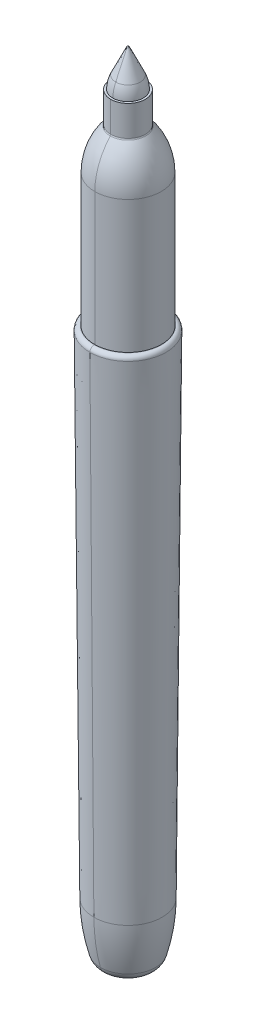
ISO-10303-21;
HEADER;
FILE_DESCRIPTION(('STEP AP214'),'2;1');
FILE_NAME('part.step','',(''),(''),'','','');
FILE_SCHEMA(('AUTOMOTIVE_DESIGN { 1 0 10303 214 1 1 1 1 }'));
ENDSEC;
DATA;
#1=APPLICATION_CONTEXT('core data for automotive mechanical design processes');
#2=APPLICATION_PROTOCOL_DEFINITION('international standard','automotive_design',2000,#1);
#3=PRODUCT_CONTEXT('',#1,'mechanical');
#4=PRODUCT('Part','Part','',(#3));
#5=PRODUCT_RELATED_PRODUCT_CATEGORY('part','',(#4));
#6=PRODUCT_DEFINITION_FORMATION('','',#4);
#7=PRODUCT_DEFINITION_CONTEXT('part definition',#1,'design');
#8=PRODUCT_DEFINITION('design','',#6,#7);
#9=PRODUCT_DEFINITION_SHAPE('','',#8);
#10=(LENGTH_UNIT() NAMED_UNIT(*) SI_UNIT(.MILLI.,.METRE.));
#11=(NAMED_UNIT(*) PLANE_ANGLE_UNIT() SI_UNIT($,.RADIAN.));
#12=(NAMED_UNIT(*) SI_UNIT($,.STERADIAN.) SOLID_ANGLE_UNIT());
#13=UNCERTAINTY_MEASURE_WITH_UNIT(LENGTH_MEASURE(1.E-05),#10,'distance_accuracy_value','');
#14=(GEOMETRIC_REPRESENTATION_CONTEXT(3) GLOBAL_UNCERTAINTY_ASSIGNED_CONTEXT((#13)) GLOBAL_UNIT_ASSIGNED_CONTEXT((#10,
#11,#12)) REPRESENTATION_CONTEXT('',''));
#15=CARTESIAN_POINT('',(0.,0.,0.));
#16=DIRECTION('',(0.,0.,1.));
#17=DIRECTION('',(1.,0.,0.));
#18=AXIS2_PLACEMENT_3D('',#15,#16,#17);
#19=CARTESIAN_POINT('',(0.,116.955274419024,0.));
#20=DIRECTION('',(0.,-1.,0.));
#21=DIRECTION('',(0.,0.,-1.));
#22=AXIS2_PLACEMENT_3D('',#19,#20,#21);
#23=TOROIDAL_SURFACE('',#22,3.09,0.3);
#24=CARTESIAN_POINT('',(0.,116.955274419024,3.09));
#25=DIRECTION('',(1.,0.,0.));
#26=DIRECTION('',(0.,0.,-1.));
#27=AXIS2_PLACEMENT_3D('',#24,#25,#26);
#28=CIRCLE('',#27,0.3);
#29=CARTESIAN_POINT('',(0.,116.755670458628,2.8660396039604));
#30=VERTEX_POINT('',#29);
#31=CARTESIAN_POINT('',(0.,116.955274419024,2.79));
#32=VERTEX_POINT('',#31);
#33=EDGE_CURVE('P0_E125',#30,#32,#28,.T.);
#34=ORIENTED_EDGE('',*,*,#33,.F.);
#35=CARTESIAN_POINT('',(0.,116.755670458628,0.));
#36=DIRECTION('',(0.,-1.,0.));
#37=DIRECTION('',(0.,0.,-1.));
#38=AXIS2_PLACEMENT_3D('',#35,#36,#37);
#39=CIRCLE('',#38,2.8660396039604);
#40=CARTESIAN_POINT('',(0.,116.755670458628,-2.8660396039604));
#41=VERTEX_POINT('',#40);
#42=EDGE_CURVE('P0_E107',#41,#30,#39,.T.);
#43=ORIENTED_EDGE('',*,*,#42,.F.);
#44=CARTESIAN_POINT('',(0.,116.955274419024,-3.09));
#45=DIRECTION('',(-1.,0.,0.));
#46=DIRECTION('',(0.,0.,1.));
#47=AXIS2_PLACEMENT_3D('',#44,#45,#46);
#48=CIRCLE('',#47,0.3);
#49=CARTESIAN_POINT('',(0.,116.955274419024,-2.79));
#50=VERTEX_POINT('',#49);
#51=EDGE_CURVE('P0_E122',#41,#50,#48,.T.);
#52=ORIENTED_EDGE('',*,*,#51,.T.);
#53=CARTESIAN_POINT('',(0.,116.955274419024,0.));
#54=DIRECTION('',(0.,1.,0.));
#55=DIRECTION('',(0.,0.,-1.));
#56=AXIS2_PLACEMENT_3D('',#53,#54,#55);
#57=CIRCLE('',#56,2.79);
#58=EDGE_CURVE('P0_E154',#32,#50,#57,.T.);
#59=ORIENTED_EDGE('',*,*,#58,.F.);
#60=EDGE_LOOP('',(#34,#43,#52,#59));
#61=FACE_BOUND('',#60,.T.);
#62=ADVANCED_FACE('P0_F17',(#61),#23,.F.);
#63=CARTESIAN_POINT('',(0.,120.84,0.));
#64=DIRECTION('',(0.,1.,0.));
#65=DIRECTION('',(1.,0.,0.));
#66=AXIS2_PLACEMENT_3D('',#63,#64,#65);
#67=PLANE('',#66);
#68=CARTESIAN_POINT('',(0.,120.84,0.));
#69=DIRECTION('',(0.,1.,0.));
#70=DIRECTION('',(0.,0.,1.));
#71=AXIS2_PLACEMENT_3D('',#68,#69,#70);
#72=CIRCLE('',#71,2.45);
#73=CARTESIAN_POINT('',(0.,120.84,2.45));
#74=VERTEX_POINT('',#73);
#75=CARTESIAN_POINT('',(0.,120.84,-2.45));
#76=VERTEX_POINT('',#75);
#77=EDGE_CURVE('P0_E11',#74,#76,#72,.T.);
#78=ORIENTED_EDGE('',*,*,#77,.T.);
#79=CARTESIAN_POINT('',(0.,120.84,0.));
#80=DIRECTION('',(0.,1.,0.));
#81=DIRECTION('',(0.,0.,1.));
#82=AXIS2_PLACEMENT_3D('',#79,#80,#81);
#83=CIRCLE('',#82,2.45);
#84=EDGE_CURVE('P0_E134',#76,#74,#83,.T.);
#85=ORIENTED_EDGE('',*,*,#84,.T.);
#86=EDGE_LOOP('',(#78,#85));
#87=FACE_BOUND('',#86,.T.);
#88=ADVANCED_FACE('P0_F318',(#87),#67,.T.);
#89=CARTESIAN_POINT('',(0.,120.84,0.));
#90=DIRECTION('',(0.,1.,0.));
#91=DIRECTION('',(0.,0.,1.));
#92=AXIS2_PLACEMENT_3D('',#89,#90,#91);
#93=CYLINDRICAL_SURFACE('',#92,2.45);
#94=DIRECTION('',(0.,1.,0.));
#95=VECTOR('',#94,1.);
#96=CARTESIAN_POINT('',(0.,120.84,-2.45));
#97=LINE('',#96,#95);
#98=CARTESIAN_POINT('',(0.,121.84,-2.45));
#99=VERTEX_POINT('',#98);
#100=EDGE_CURVE('P0_E146',#76,#99,#97,.T.);
#101=ORIENTED_EDGE('',*,*,#100,.F.);
#102=ORIENTED_EDGE('',*,*,#77,.F.);
#103=DIRECTION('',(0.,1.,0.));
#104=VECTOR('',#103,1.);
#105=CARTESIAN_POINT('',(0.,120.84,2.45));
#106=LINE('',#105,#104);
#107=CARTESIAN_POINT('',(0.,121.84,2.45));
#108=VERTEX_POINT('',#107);
#109=EDGE_CURVE('P0_E160',#74,#108,#106,.T.);
#110=ORIENTED_EDGE('',*,*,#109,.T.);
#111=CARTESIAN_POINT('',(0.,121.84,0.));
#112=DIRECTION('',(0.,1.,0.));
#113=DIRECTION('',(0.,0.,1.));
#114=AXIS2_PLACEMENT_3D('',#111,#112,#113);
#115=CIRCLE('',#114,2.45);
#116=EDGE_CURVE('P0_E68',#108,#99,#115,.T.);
#117=ORIENTED_EDGE('',*,*,#116,.T.);
#118=EDGE_LOOP('',(#101,#102,#110,#117));
#119=FACE_BOUND('',#118,.T.);
#120=ADVANCED_FACE('P0_F19',(#119),#93,.F.);
#121=CARTESIAN_POINT('',(0.,88.4,0.));
#122=DIRECTION('',(0.,-1.,0.));
#123=DIRECTION('',(0.,0.,-1.));
#124=AXIS2_PLACEMENT_3D('',#121,#122,#123);
#125=PLANE('',#124);
#126=CARTESIAN_POINT('',(0.,88.4,0.));
#127=DIRECTION('',(0.,-1.,0.));
#128=DIRECTION('',(0.,0.,-1.));
#129=AXIS2_PLACEMENT_3D('',#126,#127,#128);
#130=CIRCLE('',#129,5.35);
#131=CARTESIAN_POINT('',(0.,88.4,-5.35));
#132=VERTEX_POINT('',#131);
#133=CARTESIAN_POINT('',(0.,88.4,5.35));
#134=VERTEX_POINT('',#133);
#135=EDGE_CURVE('P0_E192',#132,#134,#130,.T.);
#136=ORIENTED_EDGE('',*,*,#135,.T.);
#137=CARTESIAN_POINT('',(0.,88.4,0.));
#138=DIRECTION('',(0.,-1.,0.));
#139=DIRECTION('',(0.,0.,-1.));
#140=AXIS2_PLACEMENT_3D('',#137,#138,#139);
#141=CIRCLE('',#140,5.35);
#142=EDGE_CURVE('P0_E28',#134,#132,#141,.T.);
#143=ORIENTED_EDGE('',*,*,#142,.T.);
#144=EDGE_LOOP('',(#136,#143));
#145=FACE_BOUND('',#144,.T.);
#146=ADVANCED_FACE('P0_F190',(#145),#125,.T.);
#147=CARTESIAN_POINT('',(0.,88.4,0.));
#148=DIRECTION('',(0.,-1.,0.));
#149=DIRECTION('',(0.,0.,-1.));
#150=AXIS2_PLACEMENT_3D('',#147,#148,#149);
#151=CYLINDRICAL_SURFACE('',#150,5.35);
#152=DIRECTION('',(0.,-1.,0.));
#153=VECTOR('',#152,1.);
#154=CARTESIAN_POINT('',(0.,88.4,5.35));
#155=LINE('',#154,#153);
#156=CARTESIAN_POINT('',(0.,110.235274419024,5.35));
#157=VERTEX_POINT('',#156);
#158=EDGE_CURVE('P0_E176',#157,#134,#155,.T.);
#159=ORIENTED_EDGE('',*,*,#158,.F.);
#160=CARTESIAN_POINT('',(0.,110.235274419024,0.));
#161=DIRECTION('',(0.,-1.,0.));
#162=DIRECTION('',(0.,0.,-1.));
#163=AXIS2_PLACEMENT_3D('',#160,#161,#162);
#164=CIRCLE('',#163,5.35);
#165=CARTESIAN_POINT('',(0.,110.235274419024,-5.35));
#166=VERTEX_POINT('',#165);
#167=EDGE_CURVE('P0_E171',#157,#166,#164,.T.);
#168=ORIENTED_EDGE('',*,*,#167,.T.);
#169=DIRECTION('',(0.,-1.,0.));
#170=VECTOR('',#169,1.);
#171=CARTESIAN_POINT('',(0.,88.4,-5.35));
#172=LINE('',#171,#170);
#173=EDGE_CURVE('P0_E21',#166,#132,#172,.T.);
#174=ORIENTED_EDGE('',*,*,#173,.T.);
#175=ORIENTED_EDGE('',*,*,#142,.F.);
#176=EDGE_LOOP('',(#159,#168,#174,#175));
#177=FACE_BOUND('',#176,.T.);
#178=ADVANCED_FACE('P0_F196',(#177),#151,.T.);
#179=CARTESIAN_POINT('',(0.,110.235274419024,0.));
#180=DIRECTION('',(0.,-1.,0.));
#181=DIRECTION('',(0.,0.,1.));
#182=AXIS2_PLACEMENT_3D('',#179,#180,#181);
#183=DEGENERATE_TOROIDAL_SURFACE('',#182,4.45,9.8,.F.);
#184=CARTESIAN_POINT('',(0.,110.235274419024,-4.45));
#185=DIRECTION('',(1.,0.,0.));
#186=DIRECTION('',(0.,0.,-1.));
#187=AXIS2_PLACEMENT_3D('',#184,#185,#186);
#188=CIRCLE('',#187,9.8);
#189=EDGE_CURVE('P0_E117',#30,#157,#188,.T.);
#190=ORIENTED_EDGE('',*,*,#189,.F.);
#191=CARTESIAN_POINT('',(0.,116.755670458628,0.));
#192=DIRECTION('',(0.,-1.,0.));
#193=DIRECTION('',(0.,0.,-1.));
#194=AXIS2_PLACEMENT_3D('',#191,#192,#193);
#195=CIRCLE('',#194,2.8660396039604);
#196=EDGE_CURVE('P0_E130',#30,#41,#195,.T.);
#197=ORIENTED_EDGE('',*,*,#196,.T.);
#198=CARTESIAN_POINT('',(0.,110.235274419024,4.45));
#199=DIRECTION('',(-1.,0.,0.));
#200=DIRECTION('',(0.,0.,1.));
#201=AXIS2_PLACEMENT_3D('',#198,#199,#200);
#202=CIRCLE('',#201,9.8);
#203=EDGE_CURVE('P0_E103',#41,#166,#202,.T.);
#204=ORIENTED_EDGE('',*,*,#203,.T.);
#205=ORIENTED_EDGE('',*,*,#167,.F.);
#206=EDGE_LOOP('',(#190,#197,#204,#205));
#207=FACE_BOUND('',#206,.T.);
#208=ADVANCED_FACE('P0_F136',(#207),#183,.F.);
#209=CARTESIAN_POINT('',(0.,88.4,0.));
#210=DIRECTION('',(0.,-1.,0.));
#211=DIRECTION('',(0.,0.,-1.));
#212=AXIS2_PLACEMENT_3D('',#209,#210,#211);
#213=CYLINDRICAL_SURFACE('',#212,2.79);
#214=DIRECTION('',(0.,-1.,0.));
#215=VECTOR('',#214,1.);
#216=CARTESIAN_POINT('',(0.,88.4,2.79));
#217=LINE('',#216,#215);
#218=CARTESIAN_POINT('',(0.,121.84,2.79));
#219=VERTEX_POINT('',#218);
#220=EDGE_CURVE('P0_E165',#219,#32,#217,.T.);
#221=ORIENTED_EDGE('',*,*,#220,.F.);
#222=CARTESIAN_POINT('',(0.,121.84,0.));
#223=DIRECTION('',(0.,-1.,0.));
#224=DIRECTION('',(0.,0.,-1.));
#225=AXIS2_PLACEMENT_3D('',#222,#223,#224);
#226=CIRCLE('',#225,2.79);
#227=CARTESIAN_POINT('',(0.,121.84,-2.79));
#228=VERTEX_POINT('',#227);
#229=EDGE_CURVE('P0_E42',#219,#228,#226,.T.);
#230=ORIENTED_EDGE('',*,*,#229,.T.);
#231=DIRECTION('',(0.,-1.,0.));
#232=VECTOR('',#231,1.);
#233=CARTESIAN_POINT('',(0.,88.4,-2.79));
#234=LINE('',#233,#232);
#235=EDGE_CURVE('P0_E151',#228,#50,#234,.T.);
#236=ORIENTED_EDGE('',*,*,#235,.T.);
#237=CARTESIAN_POINT('',(0.,116.955274419024,0.));
#238=DIRECTION('',(0.,1.,0.));
#239=DIRECTION('',(0.,0.,-1.));
#240=AXIS2_PLACEMENT_3D('',#237,#238,#239);
#241=CIRCLE('',#240,2.79);
#242=EDGE_CURVE('P0_E132',#50,#32,#241,.T.);
#243=ORIENTED_EDGE('',*,*,#242,.T.);
#244=EDGE_LOOP('',(#221,#230,#236,#243));
#245=FACE_BOUND('',#244,.T.);
#246=ADVANCED_FACE('P0_F215',(#245),#213,.T.);
#247=CARTESIAN_POINT('',(0.,121.84,0.));
#248=DIRECTION('',(0.,1.,0.));
#249=DIRECTION('',(1.,0.,0.));
#250=AXIS2_PLACEMENT_3D('',#247,#248,#249);
#251=PLANE('',#250);
#252=ORIENTED_EDGE('',*,*,#116,.F.);
#253=CARTESIAN_POINT('',(0.,121.84,0.));
#254=DIRECTION('',(0.,1.,0.));
#255=DIRECTION('',(0.,0.,1.));
#256=AXIS2_PLACEMENT_3D('',#253,#254,#255);
#257=CIRCLE('',#256,2.45);
#258=EDGE_CURVE('P0_E150',#99,#108,#257,.T.);
#259=ORIENTED_EDGE('',*,*,#258,.F.);
#260=EDGE_LOOP('',(#252,#259));
#261=FACE_BOUND('',#260,.T.);
#262=CARTESIAN_POINT('',(0.,121.84,0.));
#263=DIRECTION('',(0.,-1.,0.));
#264=DIRECTION('',(0.,0.,-1.));
#265=AXIS2_PLACEMENT_3D('',#262,#263,#264);
#266=CIRCLE('',#265,2.79);
#267=EDGE_CURVE('P0_E116',#228,#219,#266,.T.);
#268=ORIENTED_EDGE('',*,*,#267,.F.);
#269=ORIENTED_EDGE('',*,*,#229,.F.);
#270=EDGE_LOOP('',(#268,#269));
#271=FACE_BOUND('',#270,.T.);
#272=ADVANCED_FACE('P0_F342',(#261,#271),#251,.T.);
#273=CARTESIAN_POINT('',(0.,88.4,0.));
#274=DIRECTION('',(0.,-1.,0.));
#275=DIRECTION('',(0.,0.,-1.));
#276=AXIS2_PLACEMENT_3D('',#273,#274,#275);
#277=CYLINDRICAL_SURFACE('',#276,2.79);
#278=ORIENTED_EDGE('',*,*,#267,.T.);
#279=ORIENTED_EDGE('',*,*,#220,.T.);
#280=ORIENTED_EDGE('',*,*,#58,.T.);
#281=ORIENTED_EDGE('',*,*,#235,.F.);
#282=EDGE_LOOP('',(#278,#279,#280,#281));
#283=FACE_BOUND('',#282,.T.);
#284=ADVANCED_FACE('P0_F213',(#283),#277,.T.);
#285=CARTESIAN_POINT('',(0.,110.235274419024,0.));
#286=DIRECTION('',(0.,-1.,0.));
#287=DIRECTION('',(0.,0.,1.));
#288=AXIS2_PLACEMENT_3D('',#285,#286,#287);
#289=DEGENERATE_TOROIDAL_SURFACE('',#288,4.45,9.8,.F.);
#290=ORIENTED_EDGE('',*,*,#42,.T.);
#291=ORIENTED_EDGE('',*,*,#189,.T.);
#292=CARTESIAN_POINT('',(0.,110.235274419024,0.));
#293=DIRECTION('',(0.,-1.,0.));
#294=DIRECTION('',(0.,0.,-1.));
#295=AXIS2_PLACEMENT_3D('',#292,#293,#294);
#296=CIRCLE('',#295,5.35);
#297=EDGE_CURVE('P0_E110',#166,#157,#296,.T.);
#298=ORIENTED_EDGE('',*,*,#297,.F.);
#299=ORIENTED_EDGE('',*,*,#203,.F.);
#300=EDGE_LOOP('',(#290,#291,#298,#299));
#301=FACE_BOUND('',#300,.T.);
#302=ADVANCED_FACE('P0_F105',(#301),#289,.F.);
#303=CARTESIAN_POINT('',(0.,88.4,0.));
#304=DIRECTION('',(0.,-1.,0.));
#305=DIRECTION('',(0.,0.,-1.));
#306=AXIS2_PLACEMENT_3D('',#303,#304,#305);
#307=CYLINDRICAL_SURFACE('',#306,5.35);
#308=ORIENTED_EDGE('',*,*,#297,.T.);
#309=ORIENTED_EDGE('',*,*,#158,.T.);
#310=ORIENTED_EDGE('',*,*,#135,.F.);
#311=ORIENTED_EDGE('',*,*,#173,.F.);
#312=EDGE_LOOP('',(#308,#309,#310,#311));
#313=FACE_BOUND('',#312,.T.);
#314=ADVANCED_FACE('P0_F199',(#313),#307,.T.);
#315=CARTESIAN_POINT('',(0.,120.84,0.));
#316=DIRECTION('',(0.,1.,0.));
#317=DIRECTION('',(0.,0.,1.));
#318=AXIS2_PLACEMENT_3D('',#315,#316,#317);
#319=CYLINDRICAL_SURFACE('',#318,2.45);
#320=ORIENTED_EDGE('',*,*,#84,.F.);
#321=ORIENTED_EDGE('',*,*,#100,.T.);
#322=ORIENTED_EDGE('',*,*,#258,.T.);
#323=ORIENTED_EDGE('',*,*,#109,.F.);
#324=EDGE_LOOP('',(#320,#321,#322,#323));
#325=FACE_BOUND('',#324,.T.);
#326=ADVANCED_FACE('P0_F300',(#325),#319,.F.);
#327=CARTESIAN_POINT('',(0.,116.955274419024,0.));
#328=DIRECTION('',(0.,-1.,0.));
#329=DIRECTION('',(0.,0.,-1.));
#330=AXIS2_PLACEMENT_3D('',#327,#328,#329);
#331=TOROIDAL_SURFACE('',#330,3.09,0.3);
#332=ORIENTED_EDGE('',*,*,#196,.F.);
#333=ORIENTED_EDGE('',*,*,#33,.T.);
#334=ORIENTED_EDGE('',*,*,#242,.F.);
#335=ORIENTED_EDGE('',*,*,#51,.F.);
#336=EDGE_LOOP('',(#332,#333,#334,#335));
#337=FACE_BOUND('',#336,.T.);
#338=ADVANCED_FACE('P0_F129',(#337),#331,.F.);
#339=CLOSED_SHELL('',(#62,#88,#120,#146,#178,#208,#246,#272,#284,#302,#314,#326,#338));
#340=MANIFOLD_SOLID_BREP('P0_B1',#339);
#341=CARTESIAN_POINT('',(0.,88.2,0.));
#342=DIRECTION('',(0.,1.,0.));
#343=DIRECTION('',(0.,0.,1.));
#344=AXIS2_PLACEMENT_3D('',#341,#342,#343);
#345=TOROIDAL_SURFACE('',#344,5.44428221876948,0.7);
#346=CARTESIAN_POINT('',(0.,88.2,-5.44428221876948));
#347=DIRECTION('',(1.,0.,0.));
#348=DIRECTION('',(0.,0.,-1.));
#349=AXIS2_PLACEMENT_3D('',#346,#347,#348);
#350=CIRCLE('',#349,0.7);
#351=CARTESIAN_POINT('',(0.,88.1943055701554,-6.14425905657824));
#352=VERTEX_POINT('',#351);
#353=CARTESIAN_POINT('',(0.,88.9,-5.44428221876948));
#354=VERTEX_POINT('',#353);
#355=EDGE_CURVE('P1_E168',#352,#354,#350,.T.);
#356=ORIENTED_EDGE('',*,*,#355,.F.);
#357=CARTESIAN_POINT('',(0.,88.1943055701554,0.));
#358=DIRECTION('',(0.,-1.,0.));
#359=DIRECTION('',(0.,0.,-1.));
#360=AXIS2_PLACEMENT_3D('',#357,#358,#359);
#361=CIRCLE('',#360,6.14425905657824);
#362=CARTESIAN_POINT('',(0.,88.1943055701554,6.14425905657824));
#363=VERTEX_POINT('',#362);
#364=EDGE_CURVE('P1_E63',#363,#352,#361,.T.);
#365=ORIENTED_EDGE('',*,*,#364,.F.);
#366=CARTESIAN_POINT('',(0.,88.2,5.44428221876948));
#367=DIRECTION('',(-1.,0.,0.));
#368=DIRECTION('',(0.,0.,1.));
#369=AXIS2_PLACEMENT_3D('',#366,#367,#368);
#370=CIRCLE('',#369,0.7);
#371=CARTESIAN_POINT('',(0.,88.9,5.44428221876948));
#372=VERTEX_POINT('',#371);
#373=EDGE_CURVE('P1_E149',#363,#372,#370,.T.);
#374=ORIENTED_EDGE('',*,*,#373,.T.);
#375=CARTESIAN_POINT('',(0.,88.9,0.));
#376=DIRECTION('',(0.,1.,0.));
#377=DIRECTION('',(0.,0.,1.));
#378=AXIS2_PLACEMENT_3D('',#375,#376,#377);
#379=CIRCLE('',#378,5.44428221876948);
#380=EDGE_CURVE('P1_E165',#354,#372,#379,.T.);
#381=ORIENTED_EDGE('',*,*,#380,.F.);
#382=EDGE_LOOP('',(#356,#365,#374,#381));
#383=FACE_BOUND('',#382,.T.);
#384=ADVANCED_FACE('P1_F17',(#383),#345,.T.);
#385=CARTESIAN_POINT('',(0.,2.,0.));
#386=DIRECTION('',(0.,-1.,0.));
#387=DIRECTION('',(0.,0.,-1.));
#388=AXIS2_PLACEMENT_3D('',#385,#386,#387);
#389=TOROIDAL_SURFACE('',#388,2.51950574033062,2.);
#390=CARTESIAN_POINT('',(0.,2.,2.51950574033062));
#391=DIRECTION('',(1.,0.,0.));
#392=DIRECTION('',(0.,0.,-1.));
#393=AXIS2_PLACEMENT_3D('',#390,#391,#392);
#394=CIRCLE('',#393,2.);
#395=CARTESIAN_POINT('',(0.,1.46735299018811,4.44727314407477));
#396=VERTEX_POINT('',#395);
#397=CARTESIAN_POINT('',(0.,0.,2.51950574033062));
#398=VERTEX_POINT('',#397);
#399=EDGE_CURVE('P1_E127',#396,#398,#394,.T.);
#400=ORIENTED_EDGE('',*,*,#399,.F.);
#401=CARTESIAN_POINT('',(0.,1.46735299018811,0.));
#402=DIRECTION('',(0.,1.,0.));
#403=DIRECTION('',(0.,0.,1.));
#404=AXIS2_PLACEMENT_3D('',#401,#402,#403);
#405=CIRCLE('',#404,4.44727314407477);
#406=CARTESIAN_POINT('',(0.,1.46735299018811,-4.44727314407477));
#407=VERTEX_POINT('',#406);
#408=EDGE_CURVE('P1_E120',#407,#396,#405,.T.);
#409=ORIENTED_EDGE('',*,*,#408,.F.);
#410=CARTESIAN_POINT('',(0.,2.,-2.51950574033062));
#411=DIRECTION('',(-1.,0.,0.));
#412=DIRECTION('',(0.,0.,1.));
#413=AXIS2_PLACEMENT_3D('',#410,#411,#412);
#414=CIRCLE('',#413,2.);
#415=CARTESIAN_POINT('',(0.,0.,-2.51950574033062));
#416=VERTEX_POINT('',#415);
#417=EDGE_CURVE('P1_E124',#407,#416,#414,.T.);
#418=ORIENTED_EDGE('',*,*,#417,.T.);
#419=CARTESIAN_POINT('',(0.,0.,0.));
#420=DIRECTION('',(0.,-1.,0.));
#421=DIRECTION('',(0.,0.,-1.));
#422=AXIS2_PLACEMENT_3D('',#419,#420,#421);
#423=CIRCLE('',#422,2.51950574033062);
#424=EDGE_CURVE('P1_E110',#398,#416,#423,.T.);
#425=ORIENTED_EDGE('',*,*,#424,.F.);
#426=EDGE_LOOP('',(#400,#409,#418,#425));
#427=FACE_BOUND('',#426,.T.);
#428=ADVANCED_FACE('P1_F122',(#427),#389,.T.);
#429=CARTESIAN_POINT('',(0.,88.4,0.));
#430=DIRECTION('',(0.,1.,0.));
#431=DIRECTION('',(1.,0.,0.));
#432=AXIS2_PLACEMENT_3D('',#429,#430,#431);
#433=PLANE('',#432);
#434=CARTESIAN_POINT('',(0.,88.4,0.));
#435=DIRECTION('',(0.,1.,0.));
#436=DIRECTION('',(0.,0.,1.));
#437=AXIS2_PLACEMENT_3D('',#434,#435,#436);
#438=CIRCLE('',#437,5.375);
#439=CARTESIAN_POINT('',(0.,88.4,5.375));
#440=VERTEX_POINT('',#439);
#441=CARTESIAN_POINT('',(0.,88.4,-5.375));
#442=VERTEX_POINT('',#441);
#443=EDGE_CURVE('P1_E11',#440,#442,#438,.T.);
#444=ORIENTED_EDGE('',*,*,#443,.T.);
#445=CARTESIAN_POINT('',(0.,88.4,0.));
#446=DIRECTION('',(0.,1.,0.));
#447=DIRECTION('',(0.,0.,1.));
#448=AXIS2_PLACEMENT_3D('',#445,#446,#447);
#449=CIRCLE('',#448,5.375);
#450=EDGE_CURVE('P1_E145',#442,#440,#449,.T.);
#451=ORIENTED_EDGE('',*,*,#450,.T.);
#452=EDGE_LOOP('',(#444,#451));
#453=FACE_BOUND('',#452,.T.);
#454=ADVANCED_FACE('P1_F252',(#453),#433,.T.);
#455=CARTESIAN_POINT('',(0.,88.4,0.));
#456=DIRECTION('',(0.,1.,0.));
#457=DIRECTION('',(0.,0.,1.));
#458=AXIS2_PLACEMENT_3D('',#455,#456,#457);
#459=CYLINDRICAL_SURFACE('',#458,5.375);
#460=DIRECTION('',(0.,1.,0.));
#461=VECTOR('',#460,1.);
#462=CARTESIAN_POINT('',(0.,88.4,-5.375));
#463=LINE('',#462,#461);
#464=CARTESIAN_POINT('',(0.,88.9,-5.375));
#465=VERTEX_POINT('',#464);
#466=EDGE_CURVE('P1_E175',#442,#465,#463,.T.);
#467=ORIENTED_EDGE('',*,*,#466,.F.);
#468=ORIENTED_EDGE('',*,*,#443,.F.);
#469=DIRECTION('',(0.,1.,0.));
#470=VECTOR('',#469,1.);
#471=CARTESIAN_POINT('',(0.,88.4,5.375));
#472=LINE('',#471,#470);
#473=CARTESIAN_POINT('',(0.,88.9,5.375));
#474=VERTEX_POINT('',#473);
#475=EDGE_CURVE('P1_E161',#440,#474,#472,.T.);
#476=ORIENTED_EDGE('',*,*,#475,.T.);
#477=CARTESIAN_POINT('',(0.,88.9,0.));
#478=DIRECTION('',(0.,1.,0.));
#479=DIRECTION('',(0.,0.,1.));
#480=AXIS2_PLACEMENT_3D('',#477,#478,#479);
#481=CIRCLE('',#480,5.375);
#482=EDGE_CURVE('P1_E28',#474,#465,#481,.T.);
#483=ORIENTED_EDGE('',*,*,#482,.T.);
#484=EDGE_LOOP('',(#467,#468,#476,#483));
#485=FACE_BOUND('',#484,.T.);
#486=ADVANCED_FACE('P1_F19',(#485),#459,.F.);
#487=CARTESIAN_POINT('',(0.,88.9,0.));
#488=DIRECTION('',(0.,1.,0.));
#489=DIRECTION('',(1.,0.,0.));
#490=AXIS2_PLACEMENT_3D('',#487,#488,#489);
#491=PLANE('',#490);
#492=ORIENTED_EDGE('',*,*,#482,.F.);
#493=CARTESIAN_POINT('',(0.,88.9,0.));
#494=DIRECTION('',(0.,1.,0.));
#495=DIRECTION('',(0.,0.,1.));
#496=AXIS2_PLACEMENT_3D('',#493,#494,#495);
#497=CIRCLE('',#496,5.375);
#498=EDGE_CURVE('P1_E172',#465,#474,#497,.T.);
#499=ORIENTED_EDGE('',*,*,#498,.F.);
#500=EDGE_LOOP('',(#492,#499));
#501=FACE_BOUND('',#500,.T.);
#502=CARTESIAN_POINT('',(0.,88.9,0.));
#503=DIRECTION('',(0.,1.,0.));
#504=DIRECTION('',(0.,0.,1.));
#505=AXIS2_PLACEMENT_3D('',#502,#503,#504);
#506=CIRCLE('',#505,5.44428221876948);
#507=EDGE_CURVE('P1_E157',#372,#354,#506,.T.);
#508=ORIENTED_EDGE('',*,*,#507,.T.);
#509=ORIENTED_EDGE('',*,*,#380,.T.);
#510=EDGE_LOOP('',(#508,#509));
#511=FACE_BOUND('',#510,.T.);
#512=ADVANCED_FACE('P1_F226',(#501,#511),#491,.T.);
#513=CARTESIAN_POINT('',(0.,9.,0.));
#514=DIRECTION('',(0.,1.,0.));
#515=DIRECTION('',(0.,0.,1.));
#516=AXIS2_PLACEMENT_3D('',#513,#514,#515);
#517=CONICAL_SURFACE('',#516,5.5,0.00813498950385647);
#518=DIRECTION('',(0.,0.999966911155366,-0.00813489977785962));
#519=VECTOR('',#518,1.);
#520=CARTESIAN_POINT('',(0.,9.,-5.5));
#521=LINE('',#520,#519);
#522=CARTESIAN_POINT('',(0.,9.,-5.5));
#523=VERTEX_POINT('',#522);
#524=EDGE_CURVE('P1_E203',#523,#352,#521,.T.);
#525=ORIENTED_EDGE('',*,*,#524,.F.);
#526=CARTESIAN_POINT('',(0.,9.,0.));
#527=DIRECTION('',(0.,-1.,0.));
#528=DIRECTION('',(0.,0.,-1.));
#529=AXIS2_PLACEMENT_3D('',#526,#527,#528);
#530=CIRCLE('',#529,5.5);
#531=CARTESIAN_POINT('',(0.,9.,5.5));
#532=VERTEX_POINT('',#531);
#533=EDGE_CURVE('P1_E43',#532,#523,#530,.T.);
#534=ORIENTED_EDGE('',*,*,#533,.F.);
#535=DIRECTION('',(0.,0.999966911155366,0.00813489977785962));
#536=VECTOR('',#535,1.);
#537=CARTESIAN_POINT('',(0.,9.,5.5));
#538=LINE('',#537,#536);
#539=EDGE_CURVE('P1_E201',#532,#363,#538,.T.);
#540=ORIENTED_EDGE('',*,*,#539,.T.);
#541=ORIENTED_EDGE('',*,*,#364,.T.);
#542=EDGE_LOOP('',(#525,#534,#540,#541));
#543=FACE_BOUND('',#542,.T.);
#544=ADVANCED_FACE('P1_F233',(#543),#517,.T.);
#545=CARTESIAN_POINT('',(0.,9.23733552631579,0.));
#546=DIRECTION('',(0.,-1.,0.));
#547=DIRECTION('',(0.,0.,1.));
#548=AXIS2_PLACEMENT_3D('',#545,#546,#547);
#549=DEGENERATE_TOROIDAL_SURFACE('',#548,23.6740131578947,29.1749785242264,.F.);
#550=CARTESIAN_POINT('',(0.,9.23733552631579,-23.6740131578947));
#551=DIRECTION('',(1.,0.,0.));
#552=DIRECTION('',(0.,0.,-1.));
#553=AXIS2_PLACEMENT_3D('',#550,#551,#552);
#554=CIRCLE('',#553,29.1749785242264);
#555=EDGE_CURVE('P1_E139',#532,#396,#554,.T.);
#556=ORIENTED_EDGE('',*,*,#555,.F.);
#557=ORIENTED_EDGE('',*,*,#533,.T.);
#558=CARTESIAN_POINT('',(0.,9.23733552631579,23.6740131578947));
#559=DIRECTION('',(-1.,0.,0.));
#560=DIRECTION('',(0.,0.,1.));
#561=AXIS2_PLACEMENT_3D('',#558,#559,#560);
#562=CIRCLE('',#561,29.1749785242264);
#563=EDGE_CURVE('P1_E21',#523,#407,#562,.T.);
#564=ORIENTED_EDGE('',*,*,#563,.T.);
#565=ORIENTED_EDGE('',*,*,#408,.T.);
#566=EDGE_LOOP('',(#556,#557,#564,#565));
#567=FACE_BOUND('',#566,.T.);
#568=ADVANCED_FACE('P1_F134',(#567),#549,.F.);
#569=CARTESIAN_POINT('',(0.,0.,0.));
#570=DIRECTION('',(0.,-1.,0.));
#571=DIRECTION('',(0.,0.,-1.));
#572=AXIS2_PLACEMENT_3D('',#569,#570,#571);
#573=PLANE('',#572);
#574=CARTESIAN_POINT('',(0.,0.,0.));
#575=DIRECTION('',(0.,-1.,0.));
#576=DIRECTION('',(0.,0.,-1.));
#577=AXIS2_PLACEMENT_3D('',#574,#575,#576);
#578=CIRCLE('',#577,2.51950574033062);
#579=EDGE_CURVE('P1_E143',#416,#398,#578,.T.);
#580=ORIENTED_EDGE('',*,*,#579,.T.);
#581=ORIENTED_EDGE('',*,*,#424,.T.);
#582=EDGE_LOOP('',(#580,#581));
#583=FACE_BOUND('',#582,.T.);
#584=ADVANCED_FACE('P1_F241',(#583),#573,.T.);
#585=CARTESIAN_POINT('',(0.,9.23733552631579,0.));
#586=DIRECTION('',(0.,-1.,0.));
#587=DIRECTION('',(0.,0.,1.));
#588=AXIS2_PLACEMENT_3D('',#585,#586,#587);
#589=DEGENERATE_TOROIDAL_SURFACE('',#588,23.6740131578947,29.1749785242264,.F.);
#590=CARTESIAN_POINT('',(0.,9.,0.));
#591=DIRECTION('',(0.,-1.,0.));
#592=DIRECTION('',(0.,0.,-1.));
#593=AXIS2_PLACEMENT_3D('',#590,#591,#592);
#594=CIRCLE('',#593,5.5);
#595=EDGE_CURVE('P1_E183',#523,#532,#594,.T.);
#596=ORIENTED_EDGE('',*,*,#595,.T.);
#597=ORIENTED_EDGE('',*,*,#555,.T.);
#598=CARTESIAN_POINT('',(0.,1.46735299018811,0.));
#599=DIRECTION('',(0.,1.,0.));
#600=DIRECTION('',(0.,0.,1.));
#601=AXIS2_PLACEMENT_3D('',#598,#599,#600);
#602=CIRCLE('',#601,4.44727314407477);
#603=EDGE_CURVE('P1_E142',#396,#407,#602,.T.);
#604=ORIENTED_EDGE('',*,*,#603,.T.);
#605=ORIENTED_EDGE('',*,*,#563,.F.);
#606=EDGE_LOOP('',(#596,#597,#604,#605));
#607=FACE_BOUND('',#606,.T.);
#608=ADVANCED_FACE('P1_F147',(#607),#589,.F.);
#609=CARTESIAN_POINT('',(0.,9.,0.));
#610=DIRECTION('',(0.,1.,0.));
#611=DIRECTION('',(0.,0.,1.));
#612=AXIS2_PLACEMENT_3D('',#609,#610,#611);
#613=CONICAL_SURFACE('',#612,5.5,0.00813498950385647);
#614=ORIENTED_EDGE('',*,*,#595,.F.);
#615=ORIENTED_EDGE('',*,*,#524,.T.);
#616=CARTESIAN_POINT('',(0.,88.1943055701554,0.));
#617=DIRECTION('',(0.,-1.,0.));
#618=DIRECTION('',(0.,0.,-1.));
#619=AXIS2_PLACEMENT_3D('',#616,#617,#618);
#620=CIRCLE('',#619,6.14425905657824);
#621=EDGE_CURVE('P1_E171',#352,#363,#620,.T.);
#622=ORIENTED_EDGE('',*,*,#621,.T.);
#623=ORIENTED_EDGE('',*,*,#539,.F.);
#624=EDGE_LOOP('',(#614,#615,#622,#623));
#625=FACE_BOUND('',#624,.T.);
#626=ADVANCED_FACE('P1_F232',(#625),#613,.T.);
#627=CARTESIAN_POINT('',(0.,88.4,0.));
#628=DIRECTION('',(0.,1.,0.));
#629=DIRECTION('',(0.,0.,1.));
#630=AXIS2_PLACEMENT_3D('',#627,#628,#629);
#631=CYLINDRICAL_SURFACE('',#630,5.375);
#632=ORIENTED_EDGE('',*,*,#450,.F.);
#633=ORIENTED_EDGE('',*,*,#466,.T.);
#634=ORIENTED_EDGE('',*,*,#498,.T.);
#635=ORIENTED_EDGE('',*,*,#475,.F.);
#636=EDGE_LOOP('',(#632,#633,#634,#635));
#637=FACE_BOUND('',#636,.T.);
#638=ADVANCED_FACE('P1_F257',(#637),#631,.F.);
#639=CARTESIAN_POINT('',(0.,2.,0.));
#640=DIRECTION('',(0.,-1.,0.));
#641=DIRECTION('',(0.,0.,-1.));
#642=AXIS2_PLACEMENT_3D('',#639,#640,#641);
#643=TOROIDAL_SURFACE('',#642,2.51950574033062,2.);
#644=ORIENTED_EDGE('',*,*,#603,.F.);
#645=ORIENTED_EDGE('',*,*,#399,.T.);
#646=ORIENTED_EDGE('',*,*,#579,.F.);
#647=ORIENTED_EDGE('',*,*,#417,.F.);
#648=EDGE_LOOP('',(#644,#645,#646,#647));
#649=FACE_BOUND('',#648,.T.);
#650=ADVANCED_FACE('P1_F141',(#649),#643,.T.);
#651=CARTESIAN_POINT('',(0.,88.2,0.));
#652=DIRECTION('',(0.,1.,0.));
#653=DIRECTION('',(0.,0.,1.));
#654=AXIS2_PLACEMENT_3D('',#651,#652,#653);
#655=TOROIDAL_SURFACE('',#654,5.44428221876948,0.7);
#656=ORIENTED_EDGE('',*,*,#621,.F.);
#657=ORIENTED_EDGE('',*,*,#355,.T.);
#658=ORIENTED_EDGE('',*,*,#507,.F.);
#659=ORIENTED_EDGE('',*,*,#373,.F.);
#660=EDGE_LOOP('',(#656,#657,#658,#659));
#661=FACE_BOUND('',#660,.T.);
#662=ADVANCED_FACE('P1_F230',(#661),#655,.T.);
#663=CLOSED_SHELL('',(#384,#428,#454,#486,#512,#544,#568,#584,#608,#626,#638,#650,#662));
#664=MANIFOLD_SOLID_BREP('P1_B1',#663);
#665=CARTESIAN_POINT('',(0.,121.735477506972,0.));
#666=DIRECTION('',(0.,1.,0.));
#667=DIRECTION('',(0.,0.,-1.));
#668=AXIS2_PLACEMENT_3D('',#665,#666,#667);
#669=DEGENERATE_TOROIDAL_SURFACE('',#668,2.55,5.,.F.);
#670=CARTESIAN_POINT('',(0.,121.735477506972,2.55));
#671=DIRECTION('',(1.,0.,0.));
#672=DIRECTION('',(0.,0.,-1.));
#673=AXIS2_PLACEMENT_3D('',#670,#671,#672);
#674=CIRCLE('',#673,5.);
#675=CARTESIAN_POINT('',(0.,121.735477506972,-2.45));
#676=VERTEX_POINT('',#675);
#677=CARTESIAN_POINT('',(0.,123.841739443306,-1.98471726302201));
#678=VERTEX_POINT('',#677);
#679=EDGE_CURVE('P2_E83',#676,#678,#674,.T.);
#680=ORIENTED_EDGE('',*,*,#679,.F.);
#681=CARTESIAN_POINT('',(0.,121.735477506972,0.));
#682=DIRECTION('',(0.,-1.,0.));
#683=DIRECTION('',(0.,0.,1.));
#684=AXIS2_PLACEMENT_3D('',#681,#682,#683);
#685=CIRCLE('',#684,2.45);
#686=CARTESIAN_POINT('',(0.,121.735477506972,2.45));
#687=VERTEX_POINT('',#686);
#688=EDGE_CURVE('P2_E77',#687,#676,#685,.T.);
#689=ORIENTED_EDGE('',*,*,#688,.F.);
#690=CARTESIAN_POINT('',(0.,121.735477506972,-2.55));
#691=DIRECTION('',(-1.,0.,0.));
#692=DIRECTION('',(0.,0.,1.));
#693=AXIS2_PLACEMENT_3D('',#690,#691,#692);
#694=CIRCLE('',#693,5.);
#695=CARTESIAN_POINT('',(0.,123.841739443306,1.98471726302201));
#696=VERTEX_POINT('',#695);
#697=EDGE_CURVE('P2_E80',#687,#696,#694,.T.);
#698=ORIENTED_EDGE('',*,*,#697,.T.);
#699=CARTESIAN_POINT('',(0.,123.841739443306,0.));
#700=DIRECTION('',(0.,1.,0.));
#701=DIRECTION('',(0.,0.,1.));
#702=AXIS2_PLACEMENT_3D('',#699,#700,#701);
#703=CIRCLE('',#702,1.98471726302201);
#704=EDGE_CURVE('P2_E10',#678,#696,#703,.T.);
#705=ORIENTED_EDGE('',*,*,#704,.F.);
#706=EDGE_LOOP('',(#680,#689,#698,#705));
#707=FACE_BOUND('',#706,.T.);
#708=ADVANCED_FACE('P2_F16',(#707),#669,.F.);
#709=CARTESIAN_POINT('',(0.,127.64,0.));
#710=DIRECTION('',(0.,0.,1.));
#711=DIRECTION('',(1.,0.,0.));
#712=AXIS2_PLACEMENT_3D('',#709,#710,#711);
#713=SPHERICAL_SURFACE('',#712,0.200000000000006);
#714=CARTESIAN_POINT('',(0.,127.64,0.));
#715=DIRECTION('',(0.,0.,1.));
#716=DIRECTION('',(1.,0.,0.));
#717=AXIS2_PLACEMENT_3D('',#714,#715,#716);
#718=CIRCLE('',#717,0.200000000000006);
#719=CARTESIAN_POINT('',(0.,127.84,0.));
#720=VERTEX_POINT('',#719);
#721=CARTESIAN_POINT('',(-0.181388690520889,127.724250477453,0.));
#722=VERTEX_POINT('',#721);
#723=EDGE_CURVE('P2_E122',#720,#722,#718,.T.);
#724=ORIENTED_EDGE('',*,*,#723,.F.);
#725=CARTESIAN_POINT('',(0.,127.64,0.));
#726=DIRECTION('',(0.,0.,-1.));
#727=DIRECTION('',(-1.,0.,0.));
#728=AXIS2_PLACEMENT_3D('',#725,#726,#727);
#729=CIRCLE('',#728,0.200000000000006);
#730=CARTESIAN_POINT('',(0.181388690520889,127.724250477453,0.));
#731=VERTEX_POINT('',#730);
#732=EDGE_CURVE('P2_E105',#720,#731,#729,.T.);
#733=ORIENTED_EDGE('',*,*,#732,.T.);
#734=CARTESIAN_POINT('',(0.,127.724250477453,0.));
#735=DIRECTION('',(0.,-1.,0.));
#736=DIRECTION('',(0.,0.,-1.));
#737=AXIS2_PLACEMENT_3D('',#734,#735,#736);
#738=CIRCLE('',#737,0.181388690520889);
#739=CARTESIAN_POINT('',(0.,127.724250477453,-0.181388690520889));
#740=VERTEX_POINT('',#739);
#741=EDGE_CURVE('P2_E132',#740,#731,#738,.T.);
#742=ORIENTED_EDGE('',*,*,#741,.F.);
#743=CARTESIAN_POINT('',(0.,127.724250477453,0.));
#744=DIRECTION('',(0.,-1.,0.));
#745=DIRECTION('',(0.,0.,-1.));
#746=AXIS2_PLACEMENT_3D('',#743,#744,#745);
#747=CIRCLE('',#746,0.181388690520889);
#748=EDGE_CURVE('P2_E27',#722,#740,#747,.T.);
#749=ORIENTED_EDGE('',*,*,#748,.F.);
#750=EDGE_LOOP('',(#724,#733,#742,#749));
#751=FACE_BOUND('',#750,.T.);
#752=ADVANCED_FACE('P2_F162',(#751),#713,.T.);
#753=CARTESIAN_POINT('',(0.,122.84,0.));
#754=DIRECTION('',(0.,-1.,0.));
#755=DIRECTION('',(0.,0.,-1.));
#756=AXIS2_PLACEMENT_3D('',#753,#754,#755);
#757=CONICAL_SURFACE('',#756,2.45,0.43482576587961);
#758=DIRECTION('',(0.,-0.906943452604404,0.42125238726683));
#759=VECTOR('',#758,1.);
#760=CARTESIAN_POINT('',(0.,122.84,2.45));
#761=LINE('',#760,#759);
#762=CARTESIAN_POINT('',(0.,127.724250477453,0.181388690520889));
#763=VERTEX_POINT('',#762);
#764=EDGE_CURVE('P2_E118',#763,#696,#761,.T.);
#765=ORIENTED_EDGE('',*,*,#764,.F.);
#766=CARTESIAN_POINT('',(0.,127.724250477453,0.));
#767=DIRECTION('',(0.,-1.,0.));
#768=DIRECTION('',(0.,0.,-1.));
#769=AXIS2_PLACEMENT_3D('',#766,#767,#768);
#770=CIRCLE('',#769,0.181388690520889);
#771=EDGE_CURVE('P2_E146',#763,#722,#770,.T.);
#772=ORIENTED_EDGE('',*,*,#771,.T.);
#773=ORIENTED_EDGE('',*,*,#748,.T.);
#774=DIRECTION('',(0.,-0.906943452604404,-0.42125238726683));
#775=VECTOR('',#774,1.);
#776=CARTESIAN_POINT('',(0.,122.84,-2.45));
#777=LINE('',#776,#775);
#778=EDGE_CURVE('P2_E97',#740,#678,#777,.T.);
#779=ORIENTED_EDGE('',*,*,#778,.T.);
#780=ORIENTED_EDGE('',*,*,#704,.T.);
#781=EDGE_LOOP('',(#765,#772,#773,#779,#780));
#782=FACE_BOUND('',#781,.T.);
#783=ADVANCED_FACE('P2_F232',(#782),#757,.T.);
#784=CARTESIAN_POINT('',(0.,120.84,0.));
#785=DIRECTION('',(0.,-1.,0.));
#786=DIRECTION('',(0.,0.,-1.));
#787=AXIS2_PLACEMENT_3D('',#784,#785,#786);
#788=CYLINDRICAL_SURFACE('',#787,2.45);
#789=DIRECTION('',(0.,-1.,0.));
#790=VECTOR('',#789,1.);
#791=CARTESIAN_POINT('',(0.,120.84,2.45));
#792=LINE('',#791,#790);
#793=CARTESIAN_POINT('',(0.,120.84,2.45));
#794=VERTEX_POINT('',#793);
#795=EDGE_CURVE('P2_E90',#687,#794,#792,.T.);
#796=ORIENTED_EDGE('',*,*,#795,.F.);
#797=ORIENTED_EDGE('',*,*,#688,.T.);
#798=DIRECTION('',(0.,-1.,0.));
#799=VECTOR('',#798,1.);
#800=CARTESIAN_POINT('',(0.,120.84,-2.45));
#801=LINE('',#800,#799);
#802=CARTESIAN_POINT('',(0.,120.84,-2.45));
#803=VERTEX_POINT('',#802);
#804=EDGE_CURVE('P2_E108',#676,#803,#801,.T.);
#805=ORIENTED_EDGE('',*,*,#804,.T.);
#806=CARTESIAN_POINT('',(0.,120.84,0.));
#807=DIRECTION('',(0.,-1.,0.));
#808=DIRECTION('',(0.,0.,-1.));
#809=AXIS2_PLACEMENT_3D('',#806,#807,#808);
#810=CIRCLE('',#809,2.45);
#811=EDGE_CURVE('P2_E20',#794,#803,#810,.T.);
#812=ORIENTED_EDGE('',*,*,#811,.F.);
#813=EDGE_LOOP('',(#796,#797,#805,#812));
#814=FACE_BOUND('',#813,.T.);
#815=ADVANCED_FACE('P2_F91',(#814),#788,.T.);
#816=CARTESIAN_POINT('',(0.,120.84,0.));
#817=DIRECTION('',(0.,-1.,0.));
#818=DIRECTION('',(0.,0.,-1.));
#819=AXIS2_PLACEMENT_3D('',#816,#817,#818);
#820=PLANE('',#819);
#821=CARTESIAN_POINT('',(0.,120.84,0.));
#822=DIRECTION('',(0.,-1.,0.));
#823=DIRECTION('',(0.,0.,-1.));
#824=AXIS2_PLACEMENT_3D('',#821,#822,#823);
#825=CIRCLE('',#824,2.45);
#826=EDGE_CURVE('P2_E96',#803,#794,#825,.T.);
#827=ORIENTED_EDGE('',*,*,#826,.T.);
#828=ORIENTED_EDGE('',*,*,#811,.T.);
#829=EDGE_LOOP('',(#827,#828));
#830=FACE_BOUND('',#829,.T.);
#831=ADVANCED_FACE('P2_F218',(#830),#820,.T.);
#832=CARTESIAN_POINT('',(0.,120.84,0.));
#833=DIRECTION('',(0.,-1.,0.));
#834=DIRECTION('',(0.,0.,-1.));
#835=AXIS2_PLACEMENT_3D('',#832,#833,#834);
#836=CYLINDRICAL_SURFACE('',#835,2.45);
#837=CARTESIAN_POINT('',(0.,121.735477506972,0.));
#838=DIRECTION('',(0.,-1.,0.));
#839=DIRECTION('',(0.,0.,1.));
#840=AXIS2_PLACEMENT_3D('',#837,#838,#839);
#841=CIRCLE('',#840,2.45);
#842=EDGE_CURVE('P2_E101',#676,#687,#841,.T.);
#843=ORIENTED_EDGE('',*,*,#842,.T.);
#844=ORIENTED_EDGE('',*,*,#795,.T.);
#845=ORIENTED_EDGE('',*,*,#826,.F.);
#846=ORIENTED_EDGE('',*,*,#804,.F.);
#847=EDGE_LOOP('',(#843,#844,#845,#846));
#848=FACE_BOUND('',#847,.T.);
#849=ADVANCED_FACE('P2_F107',(#848),#836,.T.);
#850=CARTESIAN_POINT('',(0.,122.84,0.));
#851=DIRECTION('',(0.,-1.,0.));
#852=DIRECTION('',(0.,0.,-1.));
#853=AXIS2_PLACEMENT_3D('',#850,#851,#852);
#854=CONICAL_SURFACE('',#853,2.45,0.43482576587961);
#855=ORIENTED_EDGE('',*,*,#741,.T.);
#856=CARTESIAN_POINT('',(0.,127.724250477453,0.));
#857=DIRECTION('',(0.,-1.,0.));
#858=DIRECTION('',(0.,0.,-1.));
#859=AXIS2_PLACEMENT_3D('',#856,#857,#858);
#860=CIRCLE('',#859,0.181388690520889);
#861=EDGE_CURVE('P2_E139',#731,#763,#860,.T.);
#862=ORIENTED_EDGE('',*,*,#861,.T.);
#863=ORIENTED_EDGE('',*,*,#764,.T.);
#864=CARTESIAN_POINT('',(0.,123.841739443306,0.));
#865=DIRECTION('',(0.,1.,0.));
#866=DIRECTION('',(0.,0.,1.));
#867=AXIS2_PLACEMENT_3D('',#864,#865,#866);
#868=CIRCLE('',#867,1.98471726302201);
#869=EDGE_CURVE('P2_E103',#696,#678,#868,.T.);
#870=ORIENTED_EDGE('',*,*,#869,.T.);
#871=ORIENTED_EDGE('',*,*,#778,.F.);
#872=EDGE_LOOP('',(#855,#862,#863,#870,#871));
#873=FACE_BOUND('',#872,.T.);
#874=ADVANCED_FACE('P2_F18',(#873),#854,.T.);
#875=CARTESIAN_POINT('',(0.,127.64,0.));
#876=DIRECTION('',(0.,0.,1.));
#877=DIRECTION('',(1.,0.,0.));
#878=AXIS2_PLACEMENT_3D('',#875,#876,#877);
#879=SPHERICAL_SURFACE('',#878,0.200000000000006);
#880=ORIENTED_EDGE('',*,*,#732,.F.);
#881=ORIENTED_EDGE('',*,*,#723,.T.);
#882=ORIENTED_EDGE('',*,*,#771,.F.);
#883=ORIENTED_EDGE('',*,*,#861,.F.);
#884=EDGE_LOOP('',(#880,#881,#882,#883));
#885=FACE_BOUND('',#884,.T.);
#886=ADVANCED_FACE('P2_F166',(#885),#879,.T.);
#887=CARTESIAN_POINT('',(0.,121.735477506972,0.));
#888=DIRECTION('',(0.,1.,0.));
#889=DIRECTION('',(0.,0.,-1.));
#890=AXIS2_PLACEMENT_3D('',#887,#888,#889);
#891=DEGENERATE_TOROIDAL_SURFACE('',#890,2.55,5.,.F.);
#892=ORIENTED_EDGE('',*,*,#842,.F.);
#893=ORIENTED_EDGE('',*,*,#679,.T.);
#894=ORIENTED_EDGE('',*,*,#869,.F.);
#895=ORIENTED_EDGE('',*,*,#697,.F.);
#896=EDGE_LOOP('',(#892,#893,#894,#895));
#897=FACE_BOUND('',#896,.T.);
#898=ADVANCED_FACE('P2_F100',(#897),#891,.F.);
#899=CLOSED_SHELL('',(#708,#752,#783,#815,#831,#849,#874,#886,#898));
#900=MANIFOLD_SOLID_BREP('P2_B1',#899);
#901=ADVANCED_BREP_SHAPE_REPRESENTATION('',(#18,#340,#664,#900),#14);
#902=SHAPE_DEFINITION_REPRESENTATION(#9,#901);
ENDSEC;
END-ISO-10303-21;
